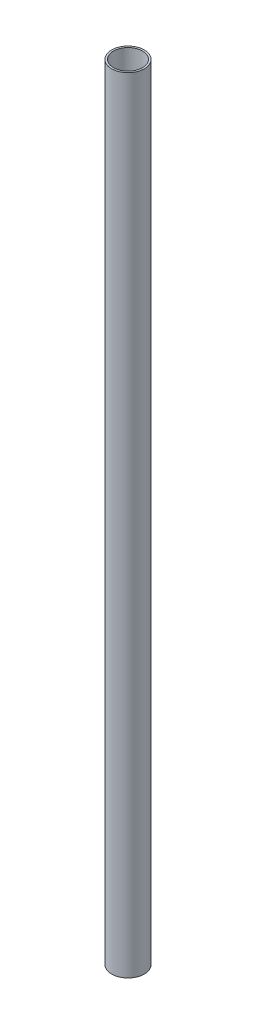
ISO-10303-21;
HEADER;
FILE_DESCRIPTION(('STEP AP214'),'2;1');
FILE_NAME('part.step','',(''),(''),'','','');
FILE_SCHEMA(('AUTOMOTIVE_DESIGN { 1 0 10303 214 1 1 1 1 }'));
ENDSEC;
DATA;
#1=APPLICATION_CONTEXT('core data for automotive mechanical design processes');
#2=APPLICATION_PROTOCOL_DEFINITION('international standard','automotive_design',2000,#1);
#3=PRODUCT_CONTEXT('',#1,'mechanical');
#4=PRODUCT('Part','Part','',(#3));
#5=PRODUCT_RELATED_PRODUCT_CATEGORY('part','',(#4));
#6=PRODUCT_DEFINITION_FORMATION('','',#4);
#7=PRODUCT_DEFINITION_CONTEXT('part definition',#1,'design');
#8=PRODUCT_DEFINITION('design','',#6,#7);
#9=PRODUCT_DEFINITION_SHAPE('','',#8);
#10=(LENGTH_UNIT() NAMED_UNIT(*) SI_UNIT(.MILLI.,.METRE.));
#11=(NAMED_UNIT(*) PLANE_ANGLE_UNIT() SI_UNIT($,.RADIAN.));
#12=(NAMED_UNIT(*) SI_UNIT($,.STERADIAN.) SOLID_ANGLE_UNIT());
#13=UNCERTAINTY_MEASURE_WITH_UNIT(LENGTH_MEASURE(1.E-05),#10,'distance_accuracy_value','');
#14=(GEOMETRIC_REPRESENTATION_CONTEXT(3) GLOBAL_UNCERTAINTY_ASSIGNED_CONTEXT((#13)) GLOBAL_UNIT_ASSIGNED_CONTEXT((#10,
#11,#12)) REPRESENTATION_CONTEXT('',''));
#15=CARTESIAN_POINT('',(0.,0.,0.));
#16=DIRECTION('',(0.,0.,1.));
#17=DIRECTION('',(1.,0.,0.));
#18=AXIS2_PLACEMENT_3D('',#15,#16,#17);
#19=CARTESIAN_POINT('',(0.,304.8,0.));
#20=DIRECTION('',(0.,1.,0.));
#21=DIRECTION('',(0.,0.,1.));
#22=AXIS2_PLACEMENT_3D('',#19,#20,#21);
#23=PLANE('',#22);
#24=CARTESIAN_POINT('',(0.,304.8,0.));
#25=DIRECTION('',(0.,1.,0.));
#26=DIRECTION('',(0.,0.,1.));
#27=AXIS2_PLACEMENT_3D('',#24,#25,#26);
#28=CIRCLE('',#27,6.35);
#29=CARTESIAN_POINT('',(0.,304.8,6.35));
#30=VERTEX_POINT('',#29);
#31=EDGE_CURVE('E10',#30,#30,#28,.T.);
#32=ORIENTED_EDGE('',*,*,#31,.T.);
#33=EDGE_LOOP('',(#32));
#34=FACE_BOUND('',#33,.T.);
#35=CARTESIAN_POINT('',(0.,304.8,0.));
#36=DIRECTION('',(0.,1.,0.));
#37=DIRECTION('',(0.,0.,1.));
#38=AXIS2_PLACEMENT_3D('',#35,#36,#37);
#39=CIRCLE('',#38,5.6388);
#40=CARTESIAN_POINT('',(0.,304.8,5.6388));
#41=VERTEX_POINT('',#40);
#42=EDGE_CURVE('E42',#41,#41,#39,.T.);
#43=ORIENTED_EDGE('',*,*,#42,.F.);
#44=EDGE_LOOP('',(#43));
#45=FACE_BOUND('',#44,.T.);
#46=ADVANCED_FACE('F31',(#34,#45),#23,.T.);
#47=CARTESIAN_POINT('',(0.,0.,0.));
#48=DIRECTION('',(0.,1.,0.));
#49=DIRECTION('',(0.,0.,1.));
#50=AXIS2_PLACEMENT_3D('',#47,#48,#49);
#51=PLANE('',#50);
#52=CARTESIAN_POINT('',(0.,0.,0.));
#53=DIRECTION('',(0.,1.,0.));
#54=DIRECTION('',(0.,0.,1.));
#55=AXIS2_PLACEMENT_3D('',#52,#53,#54);
#56=CIRCLE('',#55,6.35);
#57=CARTESIAN_POINT('',(0.,0.,6.35));
#58=VERTEX_POINT('',#57);
#59=EDGE_CURVE('E35',#58,#58,#56,.T.);
#60=ORIENTED_EDGE('',*,*,#59,.F.);
#61=EDGE_LOOP('',(#60));
#62=FACE_BOUND('',#61,.T.);
#63=CARTESIAN_POINT('',(0.,0.,0.));
#64=DIRECTION('',(0.,1.,0.));
#65=DIRECTION('',(0.,0.,1.));
#66=AXIS2_PLACEMENT_3D('',#63,#64,#65);
#67=CIRCLE('',#66,5.6388);
#68=CARTESIAN_POINT('',(0.,0.,5.6388));
#69=VERTEX_POINT('',#68);
#70=EDGE_CURVE('E44',#69,#69,#67,.T.);
#71=ORIENTED_EDGE('',*,*,#70,.T.);
#72=EDGE_LOOP('',(#71));
#73=FACE_BOUND('',#72,.T.);
#74=ADVANCED_FACE('F54',(#62,#73),#51,.F.);
#75=CARTESIAN_POINT('',(0.,304.8,0.));
#76=DIRECTION('',(0.,-1.,0.));
#77=DIRECTION('',(0.,0.,-1.));
#78=AXIS2_PLACEMENT_3D('',#75,#76,#77);
#79=CYLINDRICAL_SURFACE('',#78,6.35);
#80=ORIENTED_EDGE('',*,*,#31,.F.);
#81=EDGE_LOOP('',(#80));
#82=FACE_BOUND('',#81,.T.);
#83=ORIENTED_EDGE('',*,*,#59,.T.);
#84=EDGE_LOOP('',(#83));
#85=FACE_BOUND('',#84,.T.);
#86=ADVANCED_FACE('F33',(#82,#85),#79,.T.);
#87=CARTESIAN_POINT('',(0.,304.8,0.));
#88=DIRECTION('',(0.,-1.,0.));
#89=DIRECTION('',(0.,0.,-1.));
#90=AXIS2_PLACEMENT_3D('',#87,#88,#89);
#91=CYLINDRICAL_SURFACE('',#90,5.6388);
#92=ORIENTED_EDGE('',*,*,#42,.T.);
#93=EDGE_LOOP('',(#92));
#94=FACE_BOUND('',#93,.T.);
#95=ORIENTED_EDGE('',*,*,#70,.F.);
#96=EDGE_LOOP('',(#95));
#97=FACE_BOUND('',#96,.T.);
#98=ADVANCED_FACE('F50',(#94,#97),#91,.F.);
#99=CLOSED_SHELL('',(#46,#74,#86,#98));
#100=MANIFOLD_SOLID_BREP('B2',#99);
#101=ADVANCED_BREP_SHAPE_REPRESENTATION('',(#18,#100),#14);
#102=SHAPE_DEFINITION_REPRESENTATION(#9,#101);
ENDSEC;
END-ISO-10303-21;
